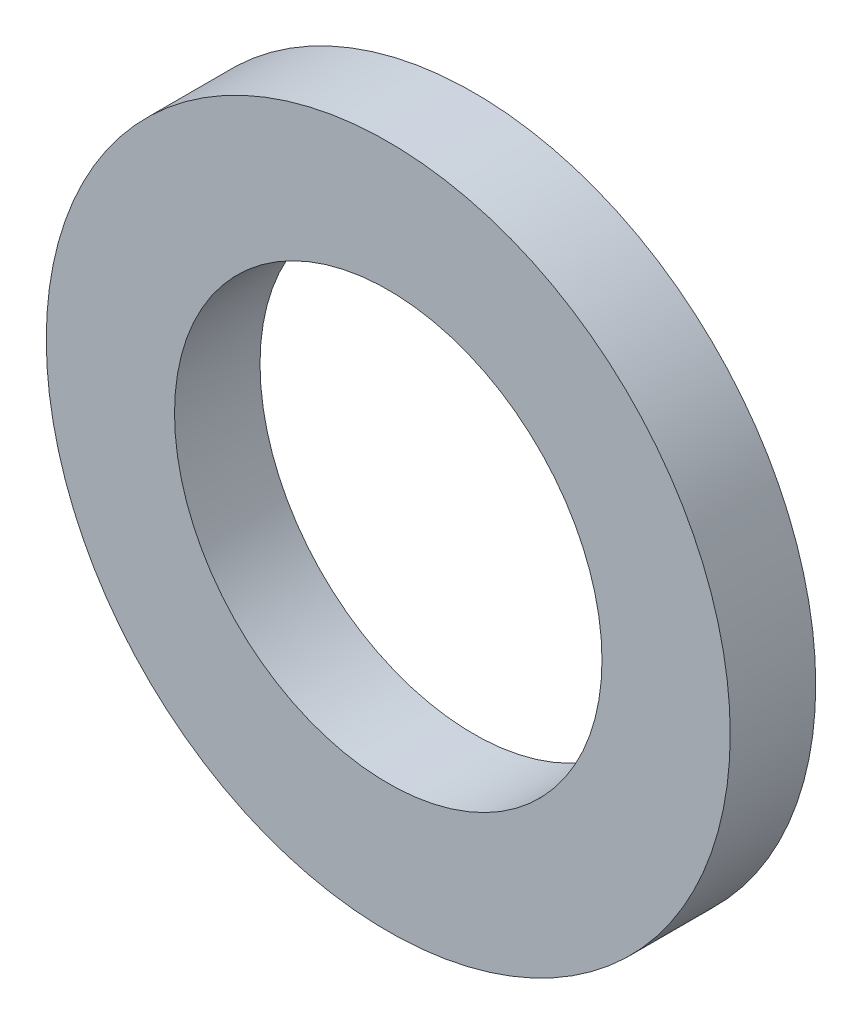
ISO-10303-21;
HEADER;
FILE_DESCRIPTION(('STEP AP214'),'2;1');
FILE_NAME('part.step','',(''),(''),'','','');
FILE_SCHEMA(('AUTOMOTIVE_DESIGN { 1 0 10303 214 1 1 1 1 }'));
ENDSEC;
DATA;
#1=APPLICATION_CONTEXT('core data for automotive mechanical design processes');
#2=APPLICATION_PROTOCOL_DEFINITION('international standard','automotive_design',2000,#1);
#3=PRODUCT_CONTEXT('',#1,'mechanical');
#4=PRODUCT('Part','Part','',(#3));
#5=PRODUCT_RELATED_PRODUCT_CATEGORY('part','',(#4));
#6=PRODUCT_DEFINITION_FORMATION('','',#4);
#7=PRODUCT_DEFINITION_CONTEXT('part definition',#1,'design');
#8=PRODUCT_DEFINITION('design','',#6,#7);
#9=PRODUCT_DEFINITION_SHAPE('','',#8);
#10=(LENGTH_UNIT() NAMED_UNIT(*) SI_UNIT(.MILLI.,.METRE.));
#11=(NAMED_UNIT(*) PLANE_ANGLE_UNIT() SI_UNIT($,.RADIAN.));
#12=(NAMED_UNIT(*) SI_UNIT($,.STERADIAN.) SOLID_ANGLE_UNIT());
#13=UNCERTAINTY_MEASURE_WITH_UNIT(LENGTH_MEASURE(1.E-05),#10,'distance_accuracy_value','');
#14=(GEOMETRIC_REPRESENTATION_CONTEXT(3) GLOBAL_UNCERTAINTY_ASSIGNED_CONTEXT((#13)) GLOBAL_UNIT_ASSIGNED_CONTEXT((#10,
#11,#12)) REPRESENTATION_CONTEXT('',''));
#15=CARTESIAN_POINT('',(0.,0.,0.));
#16=DIRECTION('',(0.,0.,1.));
#17=DIRECTION('',(1.,0.,0.));
#18=AXIS2_PLACEMENT_3D('',#15,#16,#17);
#19=CARTESIAN_POINT('',(0.,0.,1.));
#20=DIRECTION('',(0.,0.,1.));
#21=DIRECTION('',(1.,0.,0.));
#22=AXIS2_PLACEMENT_3D('',#19,#20,#21);
#23=PLANE('',#22);
#24=CARTESIAN_POINT('',(0.,0.,1.));
#25=DIRECTION('',(0.,0.,1.));
#26=DIRECTION('',(1.,0.,0.));
#27=AXIS2_PLACEMENT_3D('',#24,#25,#26);
#28=CIRCLE('',#27,4.);
#29=CARTESIAN_POINT('',(4.,0.,1.));
#30=VERTEX_POINT('',#29);
#31=EDGE_CURVE('E10',#30,#30,#28,.T.);
#32=ORIENTED_EDGE('',*,*,#31,.T.);
#33=EDGE_LOOP('',(#32));
#34=FACE_BOUND('',#33,.T.);
#35=CARTESIAN_POINT('',(0.,0.,1.));
#36=DIRECTION('',(0.,0.,1.));
#37=DIRECTION('',(1.,0.,0.));
#38=AXIS2_PLACEMENT_3D('',#35,#36,#37);
#39=CIRCLE('',#38,2.5);
#40=CARTESIAN_POINT('',(2.5,0.,1.));
#41=VERTEX_POINT('',#40);
#42=EDGE_CURVE('E50',#41,#41,#39,.T.);
#43=ORIENTED_EDGE('',*,*,#42,.F.);
#44=EDGE_LOOP('',(#43));
#45=FACE_BOUND('',#44,.T.);
#46=ADVANCED_FACE('F37',(#34,#45),#23,.T.);
#47=CARTESIAN_POINT('',(0.,0.,0.));
#48=DIRECTION('',(0.,0.,1.));
#49=DIRECTION('',(1.,0.,0.));
#50=AXIS2_PLACEMENT_3D('',#47,#48,#49);
#51=PLANE('',#50);
#52=CARTESIAN_POINT('',(0.,0.,0.));
#53=DIRECTION('',(0.,0.,1.));
#54=DIRECTION('',(1.,0.,0.));
#55=AXIS2_PLACEMENT_3D('',#52,#53,#54);
#56=CIRCLE('',#55,4.);
#57=CARTESIAN_POINT('',(4.,0.,0.));
#58=VERTEX_POINT('',#57);
#59=EDGE_CURVE('E41',#58,#58,#56,.T.);
#60=ORIENTED_EDGE('',*,*,#59,.F.);
#61=EDGE_LOOP('',(#60));
#62=FACE_BOUND('',#61,.T.);
#63=CARTESIAN_POINT('',(0.,0.,0.));
#64=DIRECTION('',(0.,0.,1.));
#65=DIRECTION('',(1.,0.,0.));
#66=AXIS2_PLACEMENT_3D('',#63,#64,#65);
#67=CIRCLE('',#66,2.5);
#68=CARTESIAN_POINT('',(2.5,0.,0.));
#69=VERTEX_POINT('',#68);
#70=EDGE_CURVE('E52',#69,#69,#67,.T.);
#71=ORIENTED_EDGE('',*,*,#70,.T.);
#72=EDGE_LOOP('',(#71));
#73=FACE_BOUND('',#72,.T.);
#74=ADVANCED_FACE('F64',(#62,#73),#51,.F.);
#75=CARTESIAN_POINT('',(0.,0.,1.));
#76=DIRECTION('',(0.,0.,-1.));
#77=DIRECTION('',(-1.,0.,0.));
#78=AXIS2_PLACEMENT_3D('',#75,#76,#77);
#79=CYLINDRICAL_SURFACE('',#78,4.);
#80=ORIENTED_EDGE('',*,*,#31,.F.);
#81=EDGE_LOOP('',(#80));
#82=FACE_BOUND('',#81,.T.);
#83=ORIENTED_EDGE('',*,*,#59,.T.);
#84=EDGE_LOOP('',(#83));
#85=FACE_BOUND('',#84,.T.);
#86=ADVANCED_FACE('F39',(#82,#85),#79,.T.);
#87=CARTESIAN_POINT('',(0.,0.,1.));
#88=DIRECTION('',(0.,0.,-1.));
#89=DIRECTION('',(-1.,0.,0.));
#90=AXIS2_PLACEMENT_3D('',#87,#88,#89);
#91=CYLINDRICAL_SURFACE('',#90,2.5);
#92=ORIENTED_EDGE('',*,*,#42,.T.);
#93=EDGE_LOOP('',(#92));
#94=FACE_BOUND('',#93,.T.);
#95=ORIENTED_EDGE('',*,*,#70,.F.);
#96=EDGE_LOOP('',(#95));
#97=FACE_BOUND('',#96,.T.);
#98=ADVANCED_FACE('F60',(#94,#97),#91,.F.);
#99=CLOSED_SHELL('',(#46,#74,#86,#98));
#100=MANIFOLD_SOLID_BREP('B2',#99);
#101=ADVANCED_BREP_SHAPE_REPRESENTATION('',(#18,#100),#14);
#102=SHAPE_DEFINITION_REPRESENTATION(#9,#101);
ENDSEC;
END-ISO-10303-21;
